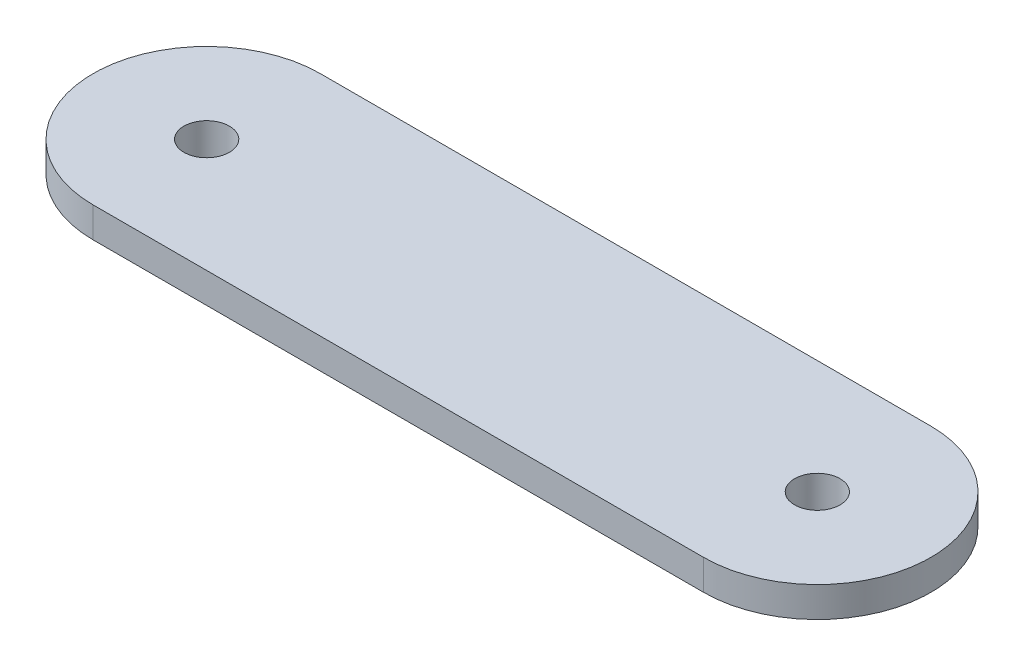
ISO-10303-21;
HEADER;
FILE_DESCRIPTION(('STEP AP214'),'2;1');
FILE_NAME('part.step','',(''),(''),'','','');
FILE_SCHEMA(('AUTOMOTIVE_DESIGN { 1 0 10303 214 1 1 1 1 }'));
ENDSEC;
DATA;
#1=APPLICATION_CONTEXT('core data for automotive mechanical design processes');
#2=APPLICATION_PROTOCOL_DEFINITION('international standard','automotive_design',2000,#1);
#3=PRODUCT_CONTEXT('',#1,'mechanical');
#4=PRODUCT('Part','Part','',(#3));
#5=PRODUCT_RELATED_PRODUCT_CATEGORY('part','',(#4));
#6=PRODUCT_DEFINITION_FORMATION('','',#4);
#7=PRODUCT_DEFINITION_CONTEXT('part definition',#1,'design');
#8=PRODUCT_DEFINITION('design','',#6,#7);
#9=PRODUCT_DEFINITION_SHAPE('','',#8);
#10=(LENGTH_UNIT() NAMED_UNIT(*) SI_UNIT(.MILLI.,.METRE.));
#11=(NAMED_UNIT(*) PLANE_ANGLE_UNIT() SI_UNIT($,.RADIAN.));
#12=(NAMED_UNIT(*) SI_UNIT($,.STERADIAN.) SOLID_ANGLE_UNIT());
#13=UNCERTAINTY_MEASURE_WITH_UNIT(LENGTH_MEASURE(1.E-05),#10,'distance_accuracy_value','');
#14=(GEOMETRIC_REPRESENTATION_CONTEXT(3) GLOBAL_UNCERTAINTY_ASSIGNED_CONTEXT((#13)) GLOBAL_UNIT_ASSIGNED_CONTEXT((#10,
#11,#12)) REPRESENTATION_CONTEXT('',''));
#15=CARTESIAN_POINT('',(0.,0.,0.));
#16=DIRECTION('',(0.,0.,1.));
#17=DIRECTION('',(1.,0.,0.));
#18=AXIS2_PLACEMENT_3D('',#15,#16,#17);
#19=CARTESIAN_POINT('',(-20.15,0.,0.));
#20=DIRECTION('',(0.,1.,0.));
#21=DIRECTION('',(0.,0.,1.));
#22=AXIS2_PLACEMENT_3D('',#19,#20,#21);
#23=PLANE('',#22);
#24=CARTESIAN_POINT('',(20.15,0.,0.));
#25=DIRECTION('',(0.,1.,0.));
#26=DIRECTION('',(0.,0.,1.));
#27=AXIS2_PLACEMENT_3D('',#24,#25,#26);
#28=CIRCLE('',#27,4.17944947177034);
#29=CARTESIAN_POINT('',(20.15,0.,4.17944947177034));
#30=VERTEX_POINT('',#29);
#31=EDGE_CURVE('E11',#30,#30,#28,.T.);
#32=ORIENTED_EDGE('',*,*,#31,.T.);
#33=EDGE_LOOP('',(#32));
#34=FACE_BOUND('',#33,.T.);
#35=CARTESIAN_POINT('',(-20.15,0.,0.));
#36=DIRECTION('',(0.,1.,0.));
#37=DIRECTION('',(0.,0.,1.));
#38=AXIS2_PLACEMENT_3D('',#35,#36,#37);
#39=CIRCLE('',#38,4.17944947177033);
#40=CARTESIAN_POINT('',(-20.15,0.,4.17944947177033));
#41=VERTEX_POINT('',#40);
#42=EDGE_CURVE('E44',#41,#41,#39,.T.);
#43=ORIENTED_EDGE('',*,*,#42,.T.);
#44=EDGE_LOOP('',(#43));
#45=FACE_BOUND('',#44,.T.);
#46=CARTESIAN_POINT('',(-20.15,0.,0.));
#47=DIRECTION('',(0.,1.,0.));
#48=DIRECTION('',(0.,0.,1.));
#49=AXIS2_PLACEMENT_3D('',#46,#47,#48);
#50=CIRCLE('',#49,7.5);
#51=CARTESIAN_POINT('',(-20.15,0.,-7.5));
#52=VERTEX_POINT('',#51);
#53=CARTESIAN_POINT('',(-20.15,0.,7.5));
#54=VERTEX_POINT('',#53);
#55=EDGE_CURVE('E103',#52,#54,#50,.T.);
#56=ORIENTED_EDGE('',*,*,#55,.F.);
#57=DIRECTION('',(-1.,0.,0.));
#58=VECTOR('',#57,1.);
#59=CARTESIAN_POINT('',(-20.15,0.,-7.5));
#60=LINE('',#59,#58);
#61=CARTESIAN_POINT('',(20.15,0.,-7.50000000000001));
#62=VERTEX_POINT('',#61);
#63=EDGE_CURVE('E75',#62,#52,#60,.T.);
#64=ORIENTED_EDGE('',*,*,#63,.F.);
#65=CARTESIAN_POINT('',(20.15,0.,0.));
#66=DIRECTION('',(0.,1.,0.));
#67=DIRECTION('',(0.,0.,1.));
#68=AXIS2_PLACEMENT_3D('',#65,#66,#67);
#69=CIRCLE('',#68,7.5);
#70=CARTESIAN_POINT('',(20.15,0.,7.5));
#71=VERTEX_POINT('',#70);
#72=EDGE_CURVE('E69',#71,#62,#69,.T.);
#73=ORIENTED_EDGE('',*,*,#72,.F.);
#74=DIRECTION('',(1.,0.,0.));
#75=VECTOR('',#74,1.);
#76=CARTESIAN_POINT('',(-20.15,0.,7.5));
#77=LINE('',#76,#75);
#78=EDGE_CURVE('E93',#54,#71,#77,.T.);
#79=ORIENTED_EDGE('',*,*,#78,.F.);
#80=EDGE_LOOP('',(#56,#64,#73,#79));
#81=FACE_BOUND('',#80,.T.);
#82=ADVANCED_FACE('F35',(#34,#45,#81),#23,.F.);
#83=CARTESIAN_POINT('',(-20.15,2.,0.));
#84=DIRECTION('',(0.,-1.,0.));
#85=DIRECTION('',(0.,0.,-1.));
#86=AXIS2_PLACEMENT_3D('',#83,#84,#85);
#87=CYLINDRICAL_SURFACE('',#86,7.5);
#88=ORIENTED_EDGE('',*,*,#55,.T.);
#89=DIRECTION('',(0.,-1.,0.));
#90=VECTOR('',#89,1.);
#91=CARTESIAN_POINT('',(-20.15,2.,7.5));
#92=LINE('',#91,#90);
#93=CARTESIAN_POINT('',(-20.15,2.,7.5));
#94=VERTEX_POINT('',#93);
#95=EDGE_CURVE('E94',#94,#54,#92,.T.);
#96=ORIENTED_EDGE('',*,*,#95,.F.);
#97=CARTESIAN_POINT('',(-20.15,2.,0.));
#98=DIRECTION('',(0.,1.,0.));
#99=DIRECTION('',(0.,0.,1.));
#100=AXIS2_PLACEMENT_3D('',#97,#98,#99);
#101=CIRCLE('',#100,7.5);
#102=CARTESIAN_POINT('',(-20.15,2.,-7.5));
#103=VERTEX_POINT('',#102);
#104=EDGE_CURVE('E88',#103,#94,#101,.T.);
#105=ORIENTED_EDGE('',*,*,#104,.F.);
#106=DIRECTION('',(0.,-1.,0.));
#107=VECTOR('',#106,1.);
#108=CARTESIAN_POINT('',(-20.15,2.,-7.5));
#109=LINE('',#108,#107);
#110=EDGE_CURVE('E99',#103,#52,#109,.T.);
#111=ORIENTED_EDGE('',*,*,#110,.T.);
#112=EDGE_LOOP('',(#88,#96,#105,#111));
#113=FACE_BOUND('',#112,.T.);
#114=ADVANCED_FACE('F156',(#113),#87,.T.);
#115=CARTESIAN_POINT('',(-20.15,2.,7.5));
#116=DIRECTION('',(0.,0.,-1.));
#117=DIRECTION('',(-1.,0.,0.));
#118=AXIS2_PLACEMENT_3D('',#115,#116,#117);
#119=PLANE('',#118);
#120=ORIENTED_EDGE('',*,*,#78,.T.);
#121=DIRECTION('',(0.,-1.,0.));
#122=VECTOR('',#121,1.);
#123=CARTESIAN_POINT('',(20.15,2.,7.5));
#124=LINE('',#123,#122);
#125=CARTESIAN_POINT('',(20.15,2.,7.5));
#126=VERTEX_POINT('',#125);
#127=EDGE_CURVE('E91',#126,#71,#124,.T.);
#128=ORIENTED_EDGE('',*,*,#127,.F.);
#129=DIRECTION('',(1.,0.,0.));
#130=VECTOR('',#129,1.);
#131=CARTESIAN_POINT('',(-20.15,2.,7.5));
#132=LINE('',#131,#130);
#133=EDGE_CURVE('E83',#94,#126,#132,.T.);
#134=ORIENTED_EDGE('',*,*,#133,.F.);
#135=ORIENTED_EDGE('',*,*,#95,.T.);
#136=EDGE_LOOP('',(#120,#128,#134,#135));
#137=FACE_BOUND('',#136,.T.);
#138=ADVANCED_FACE('F92',(#137),#119,.F.);
#139=CARTESIAN_POINT('',(20.15,2.,0.));
#140=DIRECTION('',(0.,-1.,0.));
#141=DIRECTION('',(0.,0.,-1.));
#142=AXIS2_PLACEMENT_3D('',#139,#140,#141);
#143=CYLINDRICAL_SURFACE('',#142,7.5);
#144=ORIENTED_EDGE('',*,*,#72,.T.);
#145=DIRECTION('',(0.,-1.,0.));
#146=VECTOR('',#145,1.);
#147=CARTESIAN_POINT('',(20.15,2.,-7.50000000000001));
#148=LINE('',#147,#146);
#149=CARTESIAN_POINT('',(20.15,2.,-7.50000000000001));
#150=VERTEX_POINT('',#149);
#151=EDGE_CURVE('E95',#150,#62,#148,.T.);
#152=ORIENTED_EDGE('',*,*,#151,.F.);
#153=CARTESIAN_POINT('',(20.15,2.,0.));
#154=DIRECTION('',(0.,1.,0.));
#155=DIRECTION('',(0.,0.,1.));
#156=AXIS2_PLACEMENT_3D('',#153,#154,#155);
#157=CIRCLE('',#156,7.5);
#158=EDGE_CURVE('E86',#126,#150,#157,.T.);
#159=ORIENTED_EDGE('',*,*,#158,.F.);
#160=ORIENTED_EDGE('',*,*,#127,.T.);
#161=EDGE_LOOP('',(#144,#152,#159,#160));
#162=FACE_BOUND('',#161,.T.);
#163=ADVANCED_FACE('F97',(#162),#143,.T.);
#164=CARTESIAN_POINT('',(-20.15,2.,-7.5));
#165=DIRECTION('',(0.,0.,1.));
#166=DIRECTION('',(1.,0.,0.));
#167=AXIS2_PLACEMENT_3D('',#164,#165,#166);
#168=PLANE('',#167);
#169=ORIENTED_EDGE('',*,*,#63,.T.);
#170=ORIENTED_EDGE('',*,*,#110,.F.);
#171=DIRECTION('',(-1.,0.,0.));
#172=VECTOR('',#171,1.);
#173=CARTESIAN_POINT('',(-20.15,2.,-7.5));
#174=LINE('',#173,#172);
#175=EDGE_CURVE('E52',#150,#103,#174,.T.);
#176=ORIENTED_EDGE('',*,*,#175,.F.);
#177=ORIENTED_EDGE('',*,*,#151,.T.);
#178=EDGE_LOOP('',(#169,#170,#176,#177));
#179=FACE_BOUND('',#178,.T.);
#180=ADVANCED_FACE('F167',(#179),#168,.F.);
#181=CARTESIAN_POINT('',(-20.15,2.,0.));
#182=DIRECTION('',(0.,1.,0.));
#183=DIRECTION('',(0.,0.,1.));
#184=AXIS2_PLACEMENT_3D('',#181,#182,#183);
#185=PLANE('',#184);
#186=CARTESIAN_POINT('',(-20.15,2.,0.));
#187=DIRECTION('',(0.,-1.,0.));
#188=DIRECTION('',(0.,0.,-1.));
#189=AXIS2_PLACEMENT_3D('',#186,#187,#188);
#190=CIRCLE('',#189,1.5);
#191=CARTESIAN_POINT('',(-20.15,2.,-1.5));
#192=VERTEX_POINT('',#191);
#193=EDGE_CURVE('E106',#192,#192,#190,.T.);
#194=ORIENTED_EDGE('',*,*,#193,.T.);
#195=EDGE_LOOP('',(#194));
#196=FACE_BOUND('',#195,.T.);
#197=CARTESIAN_POINT('',(20.15,2.,0.));
#198=DIRECTION('',(0.,-1.,0.));
#199=DIRECTION('',(0.,0.,-1.));
#200=AXIS2_PLACEMENT_3D('',#197,#198,#199);
#201=CIRCLE('',#200,1.5);
#202=CARTESIAN_POINT('',(20.15,2.,-1.5));
#203=VERTEX_POINT('',#202);
#204=EDGE_CURVE('E124',#203,#203,#201,.T.);
#205=ORIENTED_EDGE('',*,*,#204,.T.);
#206=EDGE_LOOP('',(#205));
#207=FACE_BOUND('',#206,.T.);
#208=ORIENTED_EDGE('',*,*,#104,.T.);
#209=ORIENTED_EDGE('',*,*,#133,.T.);
#210=ORIENTED_EDGE('',*,*,#158,.T.);
#211=ORIENTED_EDGE('',*,*,#175,.T.);
#212=EDGE_LOOP('',(#208,#209,#210,#211));
#213=FACE_BOUND('',#212,.T.);
#214=ADVANCED_FACE('F84',(#196,#207,#213),#185,.T.);
#215=CARTESIAN_POINT('',(20.15,2.,0.));
#216=DIRECTION('',(0.,-1.,0.));
#217=DIRECTION('',(0.,0.,-1.));
#218=AXIS2_PLACEMENT_3D('',#215,#216,#217);
#219=CYLINDRICAL_SURFACE('',#218,1.5);
#220=ORIENTED_EDGE('',*,*,#204,.F.);
#221=EDGE_LOOP('',(#220));
#222=FACE_BOUND('',#221,.T.);
#223=CARTESIAN_POINT('',(20.15,-0.5,0.));
#224=DIRECTION('',(0.,-1.,0.));
#225=DIRECTION('',(0.,0.,-1.));
#226=AXIS2_PLACEMENT_3D('',#223,#224,#225);
#227=CIRCLE('',#226,1.5);
#228=CARTESIAN_POINT('',(20.15,-0.5,-1.5));
#229=VERTEX_POINT('',#228);
#230=EDGE_CURVE('E181',#229,#229,#227,.T.);
#231=ORIENTED_EDGE('',*,*,#230,.T.);
#232=EDGE_LOOP('',(#231));
#233=FACE_BOUND('',#232,.T.);
#234=ADVANCED_FACE('F143',(#222,#233),#219,.F.);
#235=CARTESIAN_POINT('',(-20.15,2.,0.));
#236=DIRECTION('',(0.,-1.,0.));
#237=DIRECTION('',(0.,0.,-1.));
#238=AXIS2_PLACEMENT_3D('',#235,#236,#237);
#239=CYLINDRICAL_SURFACE('',#238,1.5);
#240=ORIENTED_EDGE('',*,*,#193,.F.);
#241=EDGE_LOOP('',(#240));
#242=FACE_BOUND('',#241,.T.);
#243=CARTESIAN_POINT('',(-20.15,-0.5,0.));
#244=DIRECTION('',(0.,-1.,0.));
#245=DIRECTION('',(0.,0.,-1.));
#246=AXIS2_PLACEMENT_3D('',#243,#244,#245);
#247=CIRCLE('',#246,1.5);
#248=CARTESIAN_POINT('',(-20.15,-0.5,-1.5));
#249=VERTEX_POINT('',#248);
#250=EDGE_CURVE('E125',#249,#249,#247,.T.);
#251=ORIENTED_EDGE('',*,*,#250,.T.);
#252=EDGE_LOOP('',(#251));
#253=FACE_BOUND('',#252,.T.);
#254=ADVANCED_FACE('F139',(#242,#253),#239,.F.);
#255=CARTESIAN_POINT('',(-20.15,-0.5,0.));
#256=DIRECTION('',(0.,-1.,0.));
#257=DIRECTION('',(0.,0.,-1.));
#258=AXIS2_PLACEMENT_3D('',#255,#256,#257);
#259=PLANE('',#258);
#260=CARTESIAN_POINT('',(-20.15,-0.5,0.));
#261=DIRECTION('',(0.,-1.,0.));
#262=DIRECTION('',(0.,0.,-1.));
#263=AXIS2_PLACEMENT_3D('',#260,#261,#262);
#264=CIRCLE('',#263,2.);
#265=CARTESIAN_POINT('',(-20.15,-0.5,-2.));
#266=VERTEX_POINT('',#265);
#267=EDGE_CURVE('E122',#266,#266,#264,.T.);
#268=ORIENTED_EDGE('',*,*,#267,.T.);
#269=EDGE_LOOP('',(#268));
#270=FACE_BOUND('',#269,.T.);
#271=ORIENTED_EDGE('',*,*,#250,.F.);
#272=EDGE_LOOP('',(#271));
#273=FACE_BOUND('',#272,.T.);
#274=ADVANCED_FACE('F142',(#270,#273),#259,.T.);
#275=CARTESIAN_POINT('',(20.15,-0.5,0.));
#276=DIRECTION('',(0.,1.,0.));
#277=DIRECTION('',(0.,0.,1.));
#278=AXIS2_PLACEMENT_3D('',#275,#276,#277);
#279=PLANE('',#278);
#280=CARTESIAN_POINT('',(20.15,-0.5,0.));
#281=DIRECTION('',(0.,-1.,0.));
#282=DIRECTION('',(0.,0.,1.));
#283=AXIS2_PLACEMENT_3D('',#280,#281,#282);
#284=CIRCLE('',#283,2.);
#285=CARTESIAN_POINT('',(20.15,-0.5,2.));
#286=VERTEX_POINT('',#285);
#287=EDGE_CURVE('E130',#286,#286,#284,.T.);
#288=ORIENTED_EDGE('',*,*,#287,.T.);
#289=EDGE_LOOP('',(#288));
#290=FACE_BOUND('',#289,.T.);
#291=ORIENTED_EDGE('',*,*,#230,.F.);
#292=EDGE_LOOP('',(#291));
#293=FACE_BOUND('',#292,.T.);
#294=ADVANCED_FACE('F148',(#290,#293),#279,.F.);
#295=CARTESIAN_POINT('',(20.15,-5.,0.));
#296=DIRECTION('',(0.,1.,0.));
#297=DIRECTION('',(0.,0.,1.));
#298=AXIS2_PLACEMENT_3D('',#295,#296,#297);
#299=DEGENERATE_TOROIDAL_SURFACE('',#298,4.17944947177034,5.,.T.);
#300=ORIENTED_EDGE('',*,*,#31,.F.);
#301=EDGE_LOOP('',(#300));
#302=FACE_BOUND('',#301,.T.);
#303=ORIENTED_EDGE('',*,*,#287,.F.);
#304=EDGE_LOOP('',(#303));
#305=FACE_BOUND('',#304,.T.);
#306=ADVANCED_FACE('F119',(#302,#305),#299,.F.);
#307=CARTESIAN_POINT('',(-20.15,-5.,0.));
#308=DIRECTION('',(0.,1.,0.));
#309=DIRECTION('',(0.,0.,1.));
#310=AXIS2_PLACEMENT_3D('',#307,#308,#309);
#311=DEGENERATE_TOROIDAL_SURFACE('',#310,4.17944947177033,5.,.T.);
#312=ORIENTED_EDGE('',*,*,#42,.F.);
#313=EDGE_LOOP('',(#312));
#314=FACE_BOUND('',#313,.T.);
#315=ORIENTED_EDGE('',*,*,#267,.F.);
#316=EDGE_LOOP('',(#315));
#317=FACE_BOUND('',#316,.T.);
#318=ADVANCED_FACE('F37',(#314,#317),#311,.F.);
#319=CLOSED_SHELL('',(#82,#114,#138,#163,#180,#214,#234,#254,#274,#294,#306,#318));
#320=MANIFOLD_SOLID_BREP('B2',#319);
#321=ADVANCED_BREP_SHAPE_REPRESENTATION('',(#18,#320),#14);
#322=SHAPE_DEFINITION_REPRESENTATION(#9,#321);
ENDSEC;
END-ISO-10303-21;
